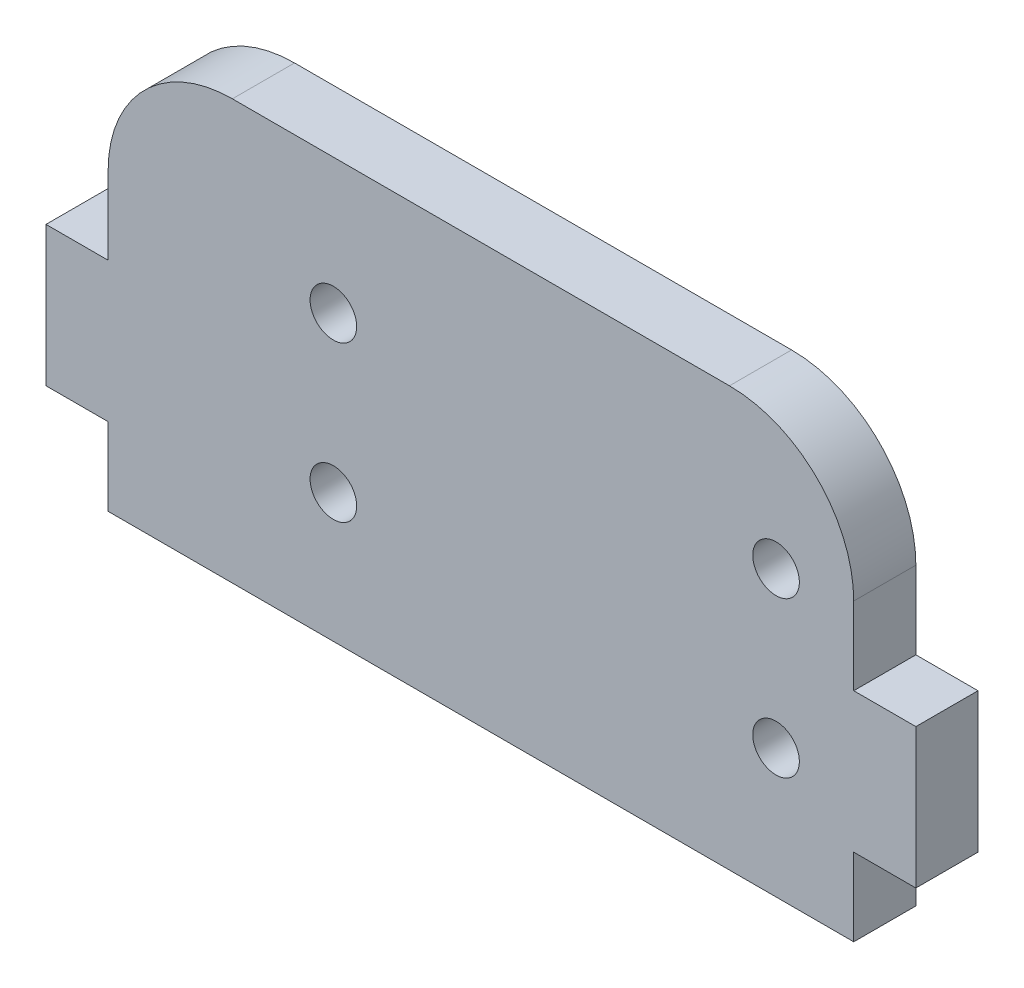
ISO-10303-21;
HEADER;
FILE_DESCRIPTION(('STEP AP214'),'2;1');
FILE_NAME('part.step','',(''),(''),'','','');
FILE_SCHEMA(('AUTOMOTIVE_DESIGN { 1 0 10303 214 1 1 1 1 }'));
ENDSEC;
DATA;
#1=APPLICATION_CONTEXT('core data for automotive mechanical design processes');
#2=APPLICATION_PROTOCOL_DEFINITION('international standard','automotive_design',2000,#1);
#3=PRODUCT_CONTEXT('',#1,'mechanical');
#4=PRODUCT('Part','Part','',(#3));
#5=PRODUCT_RELATED_PRODUCT_CATEGORY('part','',(#4));
#6=PRODUCT_DEFINITION_FORMATION('','',#4);
#7=PRODUCT_DEFINITION_CONTEXT('part definition',#1,'design');
#8=PRODUCT_DEFINITION('design','',#6,#7);
#9=PRODUCT_DEFINITION_SHAPE('','',#8);
#10=(LENGTH_UNIT() NAMED_UNIT(*) SI_UNIT(.MILLI.,.METRE.));
#11=(NAMED_UNIT(*) PLANE_ANGLE_UNIT() SI_UNIT($,.RADIAN.));
#12=(NAMED_UNIT(*) SI_UNIT($,.STERADIAN.) SOLID_ANGLE_UNIT());
#13=UNCERTAINTY_MEASURE_WITH_UNIT(LENGTH_MEASURE(1.E-05),#10,'distance_accuracy_value','');
#14=(GEOMETRIC_REPRESENTATION_CONTEXT(3) GLOBAL_UNCERTAINTY_ASSIGNED_CONTEXT((#13)) GLOBAL_UNIT_ASSIGNED_CONTEXT((#10,
#11,#12)) REPRESENTATION_CONTEXT('',''));
#15=CARTESIAN_POINT('',(0.,0.,0.));
#16=DIRECTION('',(0.,0.,1.));
#17=DIRECTION('',(1.,0.,0.));
#18=AXIS2_PLACEMENT_3D('',#15,#16,#17);
#19=CARTESIAN_POINT('',(43.9999995673073,18.99999985077,4.));
#20=DIRECTION('',(0.,0.,1.));
#21=DIRECTION('',(1.,0.,0.));
#22=AXIS2_PLACEMENT_3D('',#19,#20,#21);
#23=PLANE('',#22);
#24=CARTESIAN_POINT('',(18.4999995673073,18.29999985077,4.));
#25=DIRECTION('',(0.,0.,1.));
#26=DIRECTION('',(1.,0.,0.));
#27=AXIS2_PLACEMENT_3D('',#24,#25,#26);
#28=CIRCLE('',#27,1.5);
#29=CARTESIAN_POINT('',(19.9999995673073,18.29999985077,4.));
#30=VERTEX_POINT('',#29);
#31=EDGE_CURVE('E317',#30,#30,#28,.T.);
#32=ORIENTED_EDGE('',*,*,#31,.F.);
#33=EDGE_LOOP('',(#32));
#34=FACE_BOUND('',#33,.T.);
#35=CARTESIAN_POINT('',(46.9999995673073,18.29999985077,4.));
#36=DIRECTION('',(0.,0.,1.));
#37=DIRECTION('',(1.,0.,0.));
#38=AXIS2_PLACEMENT_3D('',#35,#36,#37);
#39=CIRCLE('',#38,1.5);
#40=CARTESIAN_POINT('',(48.4999995673073,18.29999985077,4.));
#41=VERTEX_POINT('',#40);
#42=EDGE_CURVE('E169',#41,#41,#39,.T.);
#43=ORIENTED_EDGE('',*,*,#42,.F.);
#44=EDGE_LOOP('',(#43));
#45=FACE_BOUND('',#44,.T.);
#46=DIRECTION('',(0.,-1.,0.));
#47=VECTOR('',#46,1.);
#48=CARTESIAN_POINT('',(3.99999956730733,18.99999985077,4.));
#49=LINE('',#48,#47);
#50=CARTESIAN_POINT('',(3.99999956730732,18.99999985077,4.));
#51=VERTEX_POINT('',#50);
#52=CARTESIAN_POINT('',(3.99999956730733,13.99999985077,4.));
#53=VERTEX_POINT('',#52);
#54=EDGE_CURVE('E192',#51,#53,#49,.T.);
#55=ORIENTED_EDGE('',*,*,#54,.T.);
#56=DIRECTION('',(-1.,0.,0.));
#57=VECTOR('',#56,1.);
#58=CARTESIAN_POINT('',(3.99999956730733,13.99999985077,4.));
#59=LINE('',#58,#57);
#60=CARTESIAN_POINT('',(-4.326926728E-07,13.99999985077,4.));
#61=VERTEX_POINT('',#60);
#62=EDGE_CURVE('E110',#53,#61,#59,.T.);
#63=ORIENTED_EDGE('',*,*,#62,.T.);
#64=DIRECTION('',(0.,-1.,0.));
#65=VECTOR('',#64,1.);
#66=CARTESIAN_POINT('',(-4.326926728E-07,13.99999985077,4.));
#67=LINE('',#66,#65);
#68=CARTESIAN_POINT('',(-4.326926728E-07,4.99999985076999,4.));
#69=VERTEX_POINT('',#68);
#70=EDGE_CURVE('E225',#61,#69,#67,.T.);
#71=ORIENTED_EDGE('',*,*,#70,.T.);
#72=DIRECTION('',(1.,0.,0.));
#73=VECTOR('',#72,1.);
#74=CARTESIAN_POINT('',(-4.326926728E-07,4.99999985076999,4.));
#75=LINE('',#74,#73);
#76=CARTESIAN_POINT('',(3.99999956730733,4.99999985076999,4.));
#77=VERTEX_POINT('',#76);
#78=EDGE_CURVE('E244',#69,#77,#75,.T.);
#79=ORIENTED_EDGE('',*,*,#78,.T.);
#80=DIRECTION('',(0.,-1.,0.));
#81=VECTOR('',#80,1.);
#82=CARTESIAN_POINT('',(3.99999956730733,-1.492300044E-07,4.));
#83=LINE('',#82,#81);
#84=CARTESIAN_POINT('',(3.99999956730733,-1.492300044E-07,4.));
#85=VERTEX_POINT('',#84);
#86=EDGE_CURVE('E241',#77,#85,#83,.T.);
#87=ORIENTED_EDGE('',*,*,#86,.T.);
#88=DIRECTION('',(1.,0.,0.));
#89=VECTOR('',#88,1.);
#90=CARTESIAN_POINT('',(3.99999956730733,-1.492300044E-07,4.));
#91=LINE('',#90,#89);
#92=CARTESIAN_POINT('',(51.9999995673073,-1.492300044E-07,4.));
#93=VERTEX_POINT('',#92);
#94=EDGE_CURVE('E243',#85,#93,#91,.T.);
#95=ORIENTED_EDGE('',*,*,#94,.T.);
#96=DIRECTION('',(0.,1.,0.));
#97=VECTOR('',#96,1.);
#98=CARTESIAN_POINT('',(51.9999995673073,-1.492300044E-07,4.));
#99=LINE('',#98,#97);
#100=CARTESIAN_POINT('',(51.9999995673073,4.99999985076999,4.));
#101=VERTEX_POINT('',#100);
#102=EDGE_CURVE('E246',#93,#101,#99,.T.);
#103=ORIENTED_EDGE('',*,*,#102,.T.);
#104=DIRECTION('',(1.,0.,0.));
#105=VECTOR('',#104,1.);
#106=CARTESIAN_POINT('',(55.9999995673073,4.99999985076999,4.));
#107=LINE('',#106,#105);
#108=CARTESIAN_POINT('',(55.9999995673073,4.99999985076999,4.));
#109=VERTEX_POINT('',#108);
#110=EDGE_CURVE('E252',#101,#109,#107,.T.);
#111=ORIENTED_EDGE('',*,*,#110,.T.);
#112=DIRECTION('',(0.,1.,0.));
#113=VECTOR('',#112,1.);
#114=CARTESIAN_POINT('',(55.9999995673073,13.99999985077,4.));
#115=LINE('',#114,#113);
#116=CARTESIAN_POINT('',(55.9999995673073,13.99999985077,4.));
#117=VERTEX_POINT('',#116);
#118=EDGE_CURVE('E254',#109,#117,#115,.T.);
#119=ORIENTED_EDGE('',*,*,#118,.T.);
#120=DIRECTION('',(-1.,0.,0.));
#121=VECTOR('',#120,1.);
#122=CARTESIAN_POINT('',(51.9999995673073,13.99999985077,4.));
#123=LINE('',#122,#121);
#124=CARTESIAN_POINT('',(51.9999995673073,13.99999985077,4.));
#125=VERTEX_POINT('',#124);
#126=EDGE_CURVE('E256',#117,#125,#123,.T.);
#127=ORIENTED_EDGE('',*,*,#126,.T.);
#128=DIRECTION('',(0.,1.,0.));
#129=VECTOR('',#128,1.);
#130=CARTESIAN_POINT('',(51.9999995673073,18.99999985077,4.));
#131=LINE('',#130,#129);
#132=CARTESIAN_POINT('',(51.9999995673073,18.99999985077,4.));
#133=VERTEX_POINT('',#132);
#134=EDGE_CURVE('E147',#125,#133,#131,.T.);
#135=ORIENTED_EDGE('',*,*,#134,.T.);
#136=CARTESIAN_POINT('',(43.9999995673073,18.99999985077,4.));
#137=DIRECTION('',(0.,0.,1.));
#138=DIRECTION('',(1.,0.,0.));
#139=AXIS2_PLACEMENT_3D('',#136,#137,#138);
#140=CIRCLE('',#139,8.);
#141=CARTESIAN_POINT('',(43.9999995673073,26.99999985077,4.));
#142=VERTEX_POINT('',#141);
#143=EDGE_CURVE('E141',#133,#142,#140,.T.);
#144=ORIENTED_EDGE('',*,*,#143,.T.);
#145=DIRECTION('',(-1.,0.,0.));
#146=VECTOR('',#145,1.);
#147=CARTESIAN_POINT('',(43.9999995673073,26.99999985077,4.));
#148=LINE('',#147,#146);
#149=CARTESIAN_POINT('',(11.9999995673073,26.99999985077,4.));
#150=VERTEX_POINT('',#149);
#151=EDGE_CURVE('E145',#142,#150,#148,.T.);
#152=ORIENTED_EDGE('',*,*,#151,.T.);
#153=CARTESIAN_POINT('',(11.9999995673073,18.99999985077,4.));
#154=DIRECTION('',(0.,0.,1.));
#155=DIRECTION('',(1.,0.,0.));
#156=AXIS2_PLACEMENT_3D('',#153,#154,#155);
#157=CIRCLE('',#156,8.);
#158=EDGE_CURVE('E49',#150,#51,#157,.T.);
#159=ORIENTED_EDGE('',*,*,#158,.T.);
#160=EDGE_LOOP('',(#55,#63,#71,#79,#87,#95,#103,#111,#119,#127,#135,#144,#152,#159));
#161=FACE_BOUND('',#160,.T.);
#162=CARTESIAN_POINT('',(46.9999995673073,8.29999985076993,4.));
#163=DIRECTION('',(0.,0.,1.));
#164=DIRECTION('',(1.,0.,0.));
#165=AXIS2_PLACEMENT_3D('',#162,#163,#164);
#166=CIRCLE('',#165,1.5);
#167=CARTESIAN_POINT('',(48.4999995673073,8.29999985076993,4.));
#168=VERTEX_POINT('',#167);
#169=EDGE_CURVE('E323',#168,#168,#166,.T.);
#170=ORIENTED_EDGE('',*,*,#169,.F.);
#171=EDGE_LOOP('',(#170));
#172=FACE_BOUND('',#171,.T.);
#173=CARTESIAN_POINT('',(18.4999995673073,8.29999985076993,4.));
#174=DIRECTION('',(0.,0.,1.));
#175=DIRECTION('',(1.,0.,0.));
#176=AXIS2_PLACEMENT_3D('',#173,#174,#175);
#177=CIRCLE('',#176,1.5);
#178=CARTESIAN_POINT('',(19.9999995673073,8.29999985076993,4.));
#179=VERTEX_POINT('',#178);
#180=EDGE_CURVE('E308',#179,#179,#177,.T.);
#181=ORIENTED_EDGE('',*,*,#180,.F.);
#182=EDGE_LOOP('',(#181));
#183=FACE_BOUND('',#182,.T.);
#184=ADVANCED_FACE('F32',(#34,#45,#161,#172,#183),#23,.T.);
#185=CARTESIAN_POINT('',(43.9999995673073,18.99999985077,0.));
#186=DIRECTION('',(0.,0.,1.));
#187=DIRECTION('',(1.,0.,0.));
#188=AXIS2_PLACEMENT_3D('',#185,#186,#187);
#189=PLANE('',#188);
#190=CARTESIAN_POINT('',(18.4999995673073,18.29999985077,0.));
#191=DIRECTION('',(0.,0.,1.));
#192=DIRECTION('',(1.,0.,0.));
#193=AXIS2_PLACEMENT_3D('',#190,#191,#192);
#194=CIRCLE('',#193,1.5);
#195=CARTESIAN_POINT('',(19.9999995673073,18.29999985077,0.));
#196=VERTEX_POINT('',#195);
#197=EDGE_CURVE('E314',#196,#196,#194,.T.);
#198=ORIENTED_EDGE('',*,*,#197,.T.);
#199=EDGE_LOOP('',(#198));
#200=FACE_BOUND('',#199,.T.);
#201=CARTESIAN_POINT('',(46.9999995673073,18.29999985077,0.));
#202=DIRECTION('',(0.,0.,1.));
#203=DIRECTION('',(1.,0.,0.));
#204=AXIS2_PLACEMENT_3D('',#201,#202,#203);
#205=CIRCLE('',#204,1.5);
#206=CARTESIAN_POINT('',(48.4999995673073,18.29999985077,0.));
#207=VERTEX_POINT('',#206);
#208=EDGE_CURVE('E326',#207,#207,#205,.T.);
#209=ORIENTED_EDGE('',*,*,#208,.T.);
#210=EDGE_LOOP('',(#209));
#211=FACE_BOUND('',#210,.T.);
#212=DIRECTION('',(0.,-1.,0.));
#213=VECTOR('',#212,1.);
#214=CARTESIAN_POINT('',(3.99999956730733,18.99999985077,0.));
#215=LINE('',#214,#213);
#216=CARTESIAN_POINT('',(3.99999956730732,18.99999985077,0.));
#217=VERTEX_POINT('',#216);
#218=CARTESIAN_POINT('',(3.99999956730733,13.99999985077,0.));
#219=VERTEX_POINT('',#218);
#220=EDGE_CURVE('E165',#217,#219,#215,.T.);
#221=ORIENTED_EDGE('',*,*,#220,.F.);
#222=CARTESIAN_POINT('',(11.9999995673073,18.99999985077,0.));
#223=DIRECTION('',(0.,0.,1.));
#224=DIRECTION('',(1.,0.,0.));
#225=AXIS2_PLACEMENT_3D('',#222,#223,#224);
#226=CIRCLE('',#225,8.);
#227=CARTESIAN_POINT('',(11.9999995673073,26.99999985077,0.));
#228=VERTEX_POINT('',#227);
#229=EDGE_CURVE('E102',#228,#217,#226,.T.);
#230=ORIENTED_EDGE('',*,*,#229,.F.);
#231=DIRECTION('',(-1.,0.,0.));
#232=VECTOR('',#231,1.);
#233=CARTESIAN_POINT('',(43.9999995673073,26.99999985077,0.));
#234=LINE('',#233,#232);
#235=CARTESIAN_POINT('',(43.9999995673073,26.99999985077,0.));
#236=VERTEX_POINT('',#235);
#237=EDGE_CURVE('E96',#236,#228,#234,.T.);
#238=ORIENTED_EDGE('',*,*,#237,.F.);
#239=CARTESIAN_POINT('',(43.9999995673073,18.99999985077,0.));
#240=DIRECTION('',(0.,0.,1.));
#241=DIRECTION('',(1.,0.,0.));
#242=AXIS2_PLACEMENT_3D('',#239,#240,#241);
#243=CIRCLE('',#242,8.);
#244=CARTESIAN_POINT('',(51.9999995673073,18.99999985077,0.));
#245=VERTEX_POINT('',#244);
#246=EDGE_CURVE('E155',#245,#236,#243,.T.);
#247=ORIENTED_EDGE('',*,*,#246,.F.);
#248=DIRECTION('',(0.,1.,0.));
#249=VECTOR('',#248,1.);
#250=CARTESIAN_POINT('',(51.9999995673073,18.99999985077,0.));
#251=LINE('',#250,#249);
#252=CARTESIAN_POINT('',(51.9999995673073,13.99999985077,0.));
#253=VERTEX_POINT('',#252);
#254=EDGE_CURVE('E187',#253,#245,#251,.T.);
#255=ORIENTED_EDGE('',*,*,#254,.F.);
#256=DIRECTION('',(-1.,0.,0.));
#257=VECTOR('',#256,1.);
#258=CARTESIAN_POINT('',(51.9999995673073,13.99999985077,0.));
#259=LINE('',#258,#257);
#260=CARTESIAN_POINT('',(55.9999995673073,13.99999985077,0.));
#261=VERTEX_POINT('',#260);
#262=EDGE_CURVE('E185',#261,#253,#259,.T.);
#263=ORIENTED_EDGE('',*,*,#262,.F.);
#264=DIRECTION('',(0.,1.,0.));
#265=VECTOR('',#264,1.);
#266=CARTESIAN_POINT('',(55.9999995673073,13.99999985077,0.));
#267=LINE('',#266,#265);
#268=CARTESIAN_POINT('',(55.9999995673073,4.99999985076999,0.));
#269=VERTEX_POINT('',#268);
#270=EDGE_CURVE('E183',#269,#261,#267,.T.);
#271=ORIENTED_EDGE('',*,*,#270,.F.);
#272=DIRECTION('',(1.,0.,0.));
#273=VECTOR('',#272,1.);
#274=CARTESIAN_POINT('',(55.9999995673073,4.99999985076999,0.));
#275=LINE('',#274,#273);
#276=CARTESIAN_POINT('',(51.9999995673073,4.99999985076999,0.));
#277=VERTEX_POINT('',#276);
#278=EDGE_CURVE('E181',#277,#269,#275,.T.);
#279=ORIENTED_EDGE('',*,*,#278,.F.);
#280=DIRECTION('',(0.,1.,0.));
#281=VECTOR('',#280,1.);
#282=CARTESIAN_POINT('',(51.9999995673073,-1.492300044E-07,0.));
#283=LINE('',#282,#281);
#284=CARTESIAN_POINT('',(51.9999995673073,-1.492300044E-07,0.));
#285=VERTEX_POINT('',#284);
#286=EDGE_CURVE('E179',#285,#277,#283,.T.);
#287=ORIENTED_EDGE('',*,*,#286,.F.);
#288=DIRECTION('',(1.,0.,0.));
#289=VECTOR('',#288,1.);
#290=CARTESIAN_POINT('',(3.99999956730733,-1.492300044E-07,0.));
#291=LINE('',#290,#289);
#292=CARTESIAN_POINT('',(3.99999956730733,-1.492300044E-07,0.));
#293=VERTEX_POINT('',#292);
#294=EDGE_CURVE('E177',#293,#285,#291,.T.);
#295=ORIENTED_EDGE('',*,*,#294,.F.);
#296=DIRECTION('',(0.,-1.,0.));
#297=VECTOR('',#296,1.);
#298=CARTESIAN_POINT('',(3.99999956730733,-1.492300044E-07,0.));
#299=LINE('',#298,#297);
#300=CARTESIAN_POINT('',(3.99999956730733,4.99999985076999,0.));
#301=VERTEX_POINT('',#300);
#302=EDGE_CURVE('E175',#301,#293,#299,.T.);
#303=ORIENTED_EDGE('',*,*,#302,.F.);
#304=DIRECTION('',(1.,0.,0.));
#305=VECTOR('',#304,1.);
#306=CARTESIAN_POINT('',(-4.326926728E-07,4.99999985076999,0.));
#307=LINE('',#306,#305);
#308=CARTESIAN_POINT('',(-4.326926728E-07,4.99999985076999,0.));
#309=VERTEX_POINT('',#308);
#310=EDGE_CURVE('E173',#309,#301,#307,.T.);
#311=ORIENTED_EDGE('',*,*,#310,.F.);
#312=DIRECTION('',(0.,-1.,0.));
#313=VECTOR('',#312,1.);
#314=CARTESIAN_POINT('',(-4.326926728E-07,13.99999985077,0.));
#315=LINE('',#314,#313);
#316=CARTESIAN_POINT('',(-4.326926728E-07,13.99999985077,0.));
#317=VERTEX_POINT('',#316);
#318=EDGE_CURVE('E171',#317,#309,#315,.T.);
#319=ORIENTED_EDGE('',*,*,#318,.F.);
#320=DIRECTION('',(-1.,0.,0.));
#321=VECTOR('',#320,1.);
#322=CARTESIAN_POINT('',(3.99999956730733,13.99999985077,0.));
#323=LINE('',#322,#321);
#324=EDGE_CURVE('E168',#219,#317,#323,.T.);
#325=ORIENTED_EDGE('',*,*,#324,.F.);
#326=EDGE_LOOP('',(#221,#230,#238,#247,#255,#263,#271,#279,#287,#295,#303,#311,#319,#325));
#327=FACE_BOUND('',#326,.T.);
#328=CARTESIAN_POINT('',(46.9999995673073,8.29999985076993,0.));
#329=DIRECTION('',(0.,0.,1.));
#330=DIRECTION('',(1.,0.,0.));
#331=AXIS2_PLACEMENT_3D('',#328,#329,#330);
#332=CIRCLE('',#331,1.5);
#333=CARTESIAN_POINT('',(48.4999995673073,8.29999985076993,0.));
#334=VERTEX_POINT('',#333);
#335=EDGE_CURVE('E320',#334,#334,#332,.T.);
#336=ORIENTED_EDGE('',*,*,#335,.T.);
#337=EDGE_LOOP('',(#336));
#338=FACE_BOUND('',#337,.T.);
#339=CARTESIAN_POINT('',(18.4999995673073,8.29999985076993,0.));
#340=DIRECTION('',(0.,0.,1.));
#341=DIRECTION('',(1.,0.,0.));
#342=AXIS2_PLACEMENT_3D('',#339,#340,#341);
#343=CIRCLE('',#342,1.5);
#344=CARTESIAN_POINT('',(19.9999995673073,8.29999985076993,0.));
#345=VERTEX_POINT('',#344);
#346=EDGE_CURVE('E311',#345,#345,#343,.T.);
#347=ORIENTED_EDGE('',*,*,#346,.T.);
#348=EDGE_LOOP('',(#347));
#349=FACE_BOUND('',#348,.T.);
#350=ADVANCED_FACE('F229',(#200,#211,#327,#338,#349),#189,.F.);
#351=CARTESIAN_POINT('',(3.99999956730733,18.99999985077,4.));
#352=DIRECTION('',(1.,0.,0.));
#353=DIRECTION('',(0.,0.,-1.));
#354=AXIS2_PLACEMENT_3D('',#351,#352,#353);
#355=PLANE('',#354);
#356=ORIENTED_EDGE('',*,*,#220,.T.);
#357=DIRECTION('',(0.,0.,-1.));
#358=VECTOR('',#357,1.);
#359=CARTESIAN_POINT('',(3.99999956730733,13.99999985077,4.));
#360=LINE('',#359,#358);
#361=EDGE_CURVE('E11',#53,#219,#360,.T.);
#362=ORIENTED_EDGE('',*,*,#361,.F.);
#363=ORIENTED_EDGE('',*,*,#54,.F.);
#364=DIRECTION('',(0.,0.,-1.));
#365=VECTOR('',#364,1.);
#366=CARTESIAN_POINT('',(3.99999956730732,18.99999985077,4.));
#367=LINE('',#366,#365);
#368=EDGE_CURVE('E161',#51,#217,#367,.T.);
#369=ORIENTED_EDGE('',*,*,#368,.T.);
#370=EDGE_LOOP('',(#356,#362,#363,#369));
#371=FACE_BOUND('',#370,.T.);
#372=ADVANCED_FACE('F34',(#371),#355,.F.);
#373=CARTESIAN_POINT('',(3.99999956730733,13.99999985077,4.));
#374=DIRECTION('',(0.,-1.,0.));
#375=DIRECTION('',(0.,0.,-1.));
#376=AXIS2_PLACEMENT_3D('',#373,#374,#375);
#377=PLANE('',#376);
#378=ORIENTED_EDGE('',*,*,#324,.T.);
#379=DIRECTION('',(0.,0.,-1.));
#380=VECTOR('',#379,1.);
#381=CARTESIAN_POINT('',(-4.326926728E-07,13.99999985077,4.));
#382=LINE('',#381,#380);
#383=EDGE_CURVE('E41',#61,#317,#382,.T.);
#384=ORIENTED_EDGE('',*,*,#383,.F.);
#385=ORIENTED_EDGE('',*,*,#62,.F.);
#386=ORIENTED_EDGE('',*,*,#361,.T.);
#387=EDGE_LOOP('',(#378,#384,#385,#386));
#388=FACE_BOUND('',#387,.T.);
#389=ADVANCED_FACE('F455',(#388),#377,.F.);
#390=CARTESIAN_POINT('',(-4.326926728E-07,13.99999985077,4.));
#391=DIRECTION('',(1.,0.,0.));
#392=DIRECTION('',(0.,0.,-1.));
#393=AXIS2_PLACEMENT_3D('',#390,#391,#392);
#394=PLANE('',#393);
#395=ORIENTED_EDGE('',*,*,#318,.T.);
#396=DIRECTION('',(0.,0.,-1.));
#397=VECTOR('',#396,1.);
#398=CARTESIAN_POINT('',(-4.326926728E-07,4.99999985076999,4.));
#399=LINE('',#398,#397);
#400=EDGE_CURVE('E217',#69,#309,#399,.T.);
#401=ORIENTED_EDGE('',*,*,#400,.F.);
#402=ORIENTED_EDGE('',*,*,#70,.F.);
#403=ORIENTED_EDGE('',*,*,#383,.T.);
#404=EDGE_LOOP('',(#395,#401,#402,#403));
#405=FACE_BOUND('',#404,.T.);
#406=ADVANCED_FACE('F223',(#405),#394,.F.);
#407=CARTESIAN_POINT('',(-4.326926728E-07,4.99999985076999,4.));
#408=DIRECTION('',(0.,1.,0.));
#409=DIRECTION('',(0.,0.,1.));
#410=AXIS2_PLACEMENT_3D('',#407,#408,#409);
#411=PLANE('',#410);
#412=ORIENTED_EDGE('',*,*,#310,.T.);
#413=DIRECTION('',(0.,0.,-1.));
#414=VECTOR('',#413,1.);
#415=CARTESIAN_POINT('',(3.99999956730733,4.99999985076999,4.));
#416=LINE('',#415,#414);
#417=EDGE_CURVE('E214',#77,#301,#416,.T.);
#418=ORIENTED_EDGE('',*,*,#417,.F.);
#419=ORIENTED_EDGE('',*,*,#78,.F.);
#420=ORIENTED_EDGE('',*,*,#400,.T.);
#421=EDGE_LOOP('',(#412,#418,#419,#420));
#422=FACE_BOUND('',#421,.T.);
#423=ADVANCED_FACE('F235',(#422),#411,.F.);
#424=CARTESIAN_POINT('',(3.99999956730733,-1.492300044E-07,4.));
#425=DIRECTION('',(1.,0.,0.));
#426=DIRECTION('',(0.,0.,-1.));
#427=AXIS2_PLACEMENT_3D('',#424,#425,#426);
#428=PLANE('',#427);
#429=ORIENTED_EDGE('',*,*,#302,.T.);
#430=DIRECTION('',(0.,0.,-1.));
#431=VECTOR('',#430,1.);
#432=CARTESIAN_POINT('',(3.99999956730733,-1.492300044E-07,4.));
#433=LINE('',#432,#431);
#434=EDGE_CURVE('E211',#85,#293,#433,.T.);
#435=ORIENTED_EDGE('',*,*,#434,.F.);
#436=ORIENTED_EDGE('',*,*,#86,.F.);
#437=ORIENTED_EDGE('',*,*,#417,.T.);
#438=EDGE_LOOP('',(#429,#435,#436,#437));
#439=FACE_BOUND('',#438,.T.);
#440=ADVANCED_FACE('F239',(#439),#428,.F.);
#441=CARTESIAN_POINT('',(3.99999956730733,-1.492300044E-07,4.));
#442=DIRECTION('',(0.,1.,0.));
#443=DIRECTION('',(0.,0.,1.));
#444=AXIS2_PLACEMENT_3D('',#441,#442,#443);
#445=PLANE('',#444);
#446=ORIENTED_EDGE('',*,*,#294,.T.);
#447=DIRECTION('',(0.,0.,-1.));
#448=VECTOR('',#447,1.);
#449=CARTESIAN_POINT('',(51.9999995673073,-1.492300044E-07,4.));
#450=LINE('',#449,#448);
#451=EDGE_CURVE('E208',#93,#285,#450,.T.);
#452=ORIENTED_EDGE('',*,*,#451,.F.);
#453=ORIENTED_EDGE('',*,*,#94,.F.);
#454=ORIENTED_EDGE('',*,*,#434,.T.);
#455=EDGE_LOOP('',(#446,#452,#453,#454));
#456=FACE_BOUND('',#455,.T.);
#457=ADVANCED_FACE('F420',(#456),#445,.F.);
#458=CARTESIAN_POINT('',(51.9999995673073,-1.492300044E-07,4.));
#459=DIRECTION('',(-1.,0.,0.));
#460=DIRECTION('',(0.,0.,1.));
#461=AXIS2_PLACEMENT_3D('',#458,#459,#460);
#462=PLANE('',#461);
#463=ORIENTED_EDGE('',*,*,#286,.T.);
#464=DIRECTION('',(0.,0.,-1.));
#465=VECTOR('',#464,1.);
#466=CARTESIAN_POINT('',(51.9999995673073,4.99999985076999,4.));
#467=LINE('',#466,#465);
#468=EDGE_CURVE('E205',#101,#277,#467,.T.);
#469=ORIENTED_EDGE('',*,*,#468,.F.);
#470=ORIENTED_EDGE('',*,*,#102,.F.);
#471=ORIENTED_EDGE('',*,*,#451,.T.);
#472=EDGE_LOOP('',(#463,#469,#470,#471));
#473=FACE_BOUND('',#472,.T.);
#474=ADVANCED_FACE('F410',(#473),#462,.F.);
#475=CARTESIAN_POINT('',(55.9999995673073,4.99999985076999,4.));
#476=DIRECTION('',(0.,1.,0.));
#477=DIRECTION('',(0.,0.,1.));
#478=AXIS2_PLACEMENT_3D('',#475,#476,#477);
#479=PLANE('',#478);
#480=ORIENTED_EDGE('',*,*,#278,.T.);
#481=DIRECTION('',(0.,0.,-1.));
#482=VECTOR('',#481,1.);
#483=CARTESIAN_POINT('',(55.9999995673073,4.99999985076999,4.));
#484=LINE('',#483,#482);
#485=EDGE_CURVE('E202',#109,#269,#484,.T.);
#486=ORIENTED_EDGE('',*,*,#485,.F.);
#487=ORIENTED_EDGE('',*,*,#110,.F.);
#488=ORIENTED_EDGE('',*,*,#468,.T.);
#489=EDGE_LOOP('',(#480,#486,#487,#488));
#490=FACE_BOUND('',#489,.T.);
#491=ADVANCED_FACE('F400',(#490),#479,.F.);
#492=CARTESIAN_POINT('',(55.9999995673073,13.99999985077,4.));
#493=DIRECTION('',(-1.,0.,0.));
#494=DIRECTION('',(0.,0.,1.));
#495=AXIS2_PLACEMENT_3D('',#492,#493,#494);
#496=PLANE('',#495);
#497=ORIENTED_EDGE('',*,*,#270,.T.);
#498=DIRECTION('',(0.,0.,-1.));
#499=VECTOR('',#498,1.);
#500=CARTESIAN_POINT('',(55.9999995673073,13.99999985077,4.));
#501=LINE('',#500,#499);
#502=EDGE_CURVE('E199',#117,#261,#501,.T.);
#503=ORIENTED_EDGE('',*,*,#502,.F.);
#504=ORIENTED_EDGE('',*,*,#118,.F.);
#505=ORIENTED_EDGE('',*,*,#485,.T.);
#506=EDGE_LOOP('',(#497,#503,#504,#505));
#507=FACE_BOUND('',#506,.T.);
#508=ADVANCED_FACE('F391',(#507),#496,.F.);
#509=CARTESIAN_POINT('',(51.9999995673073,13.99999985077,4.));
#510=DIRECTION('',(0.,-1.,0.));
#511=DIRECTION('',(0.,0.,-1.));
#512=AXIS2_PLACEMENT_3D('',#509,#510,#511);
#513=PLANE('',#512);
#514=ORIENTED_EDGE('',*,*,#262,.T.);
#515=DIRECTION('',(0.,0.,-1.));
#516=VECTOR('',#515,1.);
#517=CARTESIAN_POINT('',(51.9999995673073,13.99999985077,4.));
#518=LINE('',#517,#516);
#519=EDGE_CURVE('E196',#125,#253,#518,.T.);
#520=ORIENTED_EDGE('',*,*,#519,.F.);
#521=ORIENTED_EDGE('',*,*,#126,.F.);
#522=ORIENTED_EDGE('',*,*,#502,.T.);
#523=EDGE_LOOP('',(#514,#520,#521,#522));
#524=FACE_BOUND('',#523,.T.);
#525=ADVANCED_FACE('F262',(#524),#513,.F.);
#526=CARTESIAN_POINT('',(51.9999995673073,18.99999985077,4.));
#527=DIRECTION('',(-1.,0.,0.));
#528=DIRECTION('',(0.,0.,1.));
#529=AXIS2_PLACEMENT_3D('',#526,#527,#528);
#530=PLANE('',#529);
#531=ORIENTED_EDGE('',*,*,#254,.T.);
#532=DIRECTION('',(0.,0.,-1.));
#533=VECTOR('',#532,1.);
#534=CARTESIAN_POINT('',(51.9999995673073,18.99999985077,4.));
#535=LINE('',#534,#533);
#536=EDGE_CURVE('E156',#133,#245,#535,.T.);
#537=ORIENTED_EDGE('',*,*,#536,.F.);
#538=ORIENTED_EDGE('',*,*,#134,.F.);
#539=ORIENTED_EDGE('',*,*,#519,.T.);
#540=EDGE_LOOP('',(#531,#537,#538,#539));
#541=FACE_BOUND('',#540,.T.);
#542=ADVANCED_FACE('F266',(#541),#530,.F.);
#543=CARTESIAN_POINT('',(43.9999995673073,18.99999985077,4.));
#544=DIRECTION('',(0.,0.,-1.));
#545=DIRECTION('',(-1.,0.,0.));
#546=AXIS2_PLACEMENT_3D('',#543,#544,#545);
#547=CYLINDRICAL_SURFACE('',#546,8.);
#548=ORIENTED_EDGE('',*,*,#246,.T.);
#549=DIRECTION('',(0.,0.,-1.));
#550=VECTOR('',#549,1.);
#551=CARTESIAN_POINT('',(43.9999995673073,26.99999985077,4.));
#552=LINE('',#551,#550);
#553=EDGE_CURVE('E152',#142,#236,#552,.T.);
#554=ORIENTED_EDGE('',*,*,#553,.F.);
#555=ORIENTED_EDGE('',*,*,#143,.F.);
#556=ORIENTED_EDGE('',*,*,#536,.T.);
#557=EDGE_LOOP('',(#548,#554,#555,#556));
#558=FACE_BOUND('',#557,.T.);
#559=ADVANCED_FACE('F153',(#558),#547,.T.);
#560=CARTESIAN_POINT('',(43.9999995673073,26.99999985077,4.));
#561=DIRECTION('',(0.,-1.,0.));
#562=DIRECTION('',(0.,0.,-1.));
#563=AXIS2_PLACEMENT_3D('',#560,#561,#562);
#564=PLANE('',#563);
#565=ORIENTED_EDGE('',*,*,#237,.T.);
#566=DIRECTION('',(0.,0.,-1.));
#567=VECTOR('',#566,1.);
#568=CARTESIAN_POINT('',(11.9999995673073,26.99999985077,4.));
#569=LINE('',#568,#567);
#570=EDGE_CURVE('E157',#150,#228,#569,.T.);
#571=ORIENTED_EDGE('',*,*,#570,.F.);
#572=ORIENTED_EDGE('',*,*,#151,.F.);
#573=ORIENTED_EDGE('',*,*,#553,.T.);
#574=EDGE_LOOP('',(#565,#571,#572,#573));
#575=FACE_BOUND('',#574,.T.);
#576=ADVANCED_FACE('F159',(#575),#564,.F.);
#577=CARTESIAN_POINT('',(11.9999995673073,18.99999985077,4.));
#578=DIRECTION('',(0.,0.,-1.));
#579=DIRECTION('',(-1.,0.,0.));
#580=AXIS2_PLACEMENT_3D('',#577,#578,#579);
#581=CYLINDRICAL_SURFACE('',#580,8.);
#582=ORIENTED_EDGE('',*,*,#229,.T.);
#583=ORIENTED_EDGE('',*,*,#368,.F.);
#584=ORIENTED_EDGE('',*,*,#158,.F.);
#585=ORIENTED_EDGE('',*,*,#570,.T.);
#586=EDGE_LOOP('',(#582,#583,#584,#585));
#587=FACE_BOUND('',#586,.T.);
#588=ADVANCED_FACE('F270',(#587),#581,.T.);
#589=CARTESIAN_POINT('',(46.9999995673073,18.29999985077,4.));
#590=DIRECTION('',(0.,0.,-1.));
#591=DIRECTION('',(-1.,0.,0.));
#592=AXIS2_PLACEMENT_3D('',#589,#590,#591);
#593=CYLINDRICAL_SURFACE('',#592,1.5);
#594=ORIENTED_EDGE('',*,*,#42,.T.);
#595=EDGE_LOOP('',(#594));
#596=FACE_BOUND('',#595,.T.);
#597=ORIENTED_EDGE('',*,*,#208,.F.);
#598=EDGE_LOOP('',(#597));
#599=FACE_BOUND('',#598,.T.);
#600=ADVANCED_FACE('F272',(#596,#599),#593,.F.);
#601=CARTESIAN_POINT('',(46.9999995673073,8.29999985076993,4.));
#602=DIRECTION('',(0.,0.,-1.));
#603=DIRECTION('',(-1.,0.,0.));
#604=AXIS2_PLACEMENT_3D('',#601,#602,#603);
#605=CYLINDRICAL_SURFACE('',#604,1.5);
#606=ORIENTED_EDGE('',*,*,#169,.T.);
#607=EDGE_LOOP('',(#606));
#608=FACE_BOUND('',#607,.T.);
#609=ORIENTED_EDGE('',*,*,#335,.F.);
#610=EDGE_LOOP('',(#609));
#611=FACE_BOUND('',#610,.T.);
#612=ADVANCED_FACE('F278',(#608,#611),#605,.F.);
#613=CARTESIAN_POINT('',(18.4999995673073,18.29999985077,4.));
#614=DIRECTION('',(0.,0.,-1.));
#615=DIRECTION('',(-1.,0.,0.));
#616=AXIS2_PLACEMENT_3D('',#613,#614,#615);
#617=CYLINDRICAL_SURFACE('',#616,1.5);
#618=ORIENTED_EDGE('',*,*,#31,.T.);
#619=EDGE_LOOP('',(#618));
#620=FACE_BOUND('',#619,.T.);
#621=ORIENTED_EDGE('',*,*,#197,.F.);
#622=EDGE_LOOP('',(#621));
#623=FACE_BOUND('',#622,.T.);
#624=ADVANCED_FACE('F295',(#620,#623),#617,.F.);
#625=CARTESIAN_POINT('',(18.4999995673073,8.29999985076993,4.));
#626=DIRECTION('',(0.,0.,-1.));
#627=DIRECTION('',(-1.,0.,0.));
#628=AXIS2_PLACEMENT_3D('',#625,#626,#627);
#629=CYLINDRICAL_SURFACE('',#628,1.5);
#630=ORIENTED_EDGE('',*,*,#180,.T.);
#631=EDGE_LOOP('',(#630));
#632=FACE_BOUND('',#631,.T.);
#633=ORIENTED_EDGE('',*,*,#346,.F.);
#634=EDGE_LOOP('',(#633));
#635=FACE_BOUND('',#634,.T.);
#636=ADVANCED_FACE('F299',(#632,#635),#629,.F.);
#637=CLOSED_SHELL('',(#184,#350,#372,#389,#406,#423,#440,#457,#474,#491,#508,#525,#542,#559,
#576,#588,#600,#612,#624,#636));
#638=MANIFOLD_SOLID_BREP('B2',#637);
#639=ADVANCED_BREP_SHAPE_REPRESENTATION('',(#18,#638),#14);
#640=SHAPE_DEFINITION_REPRESENTATION(#9,#639);
ENDSEC;
END-ISO-10303-21;
